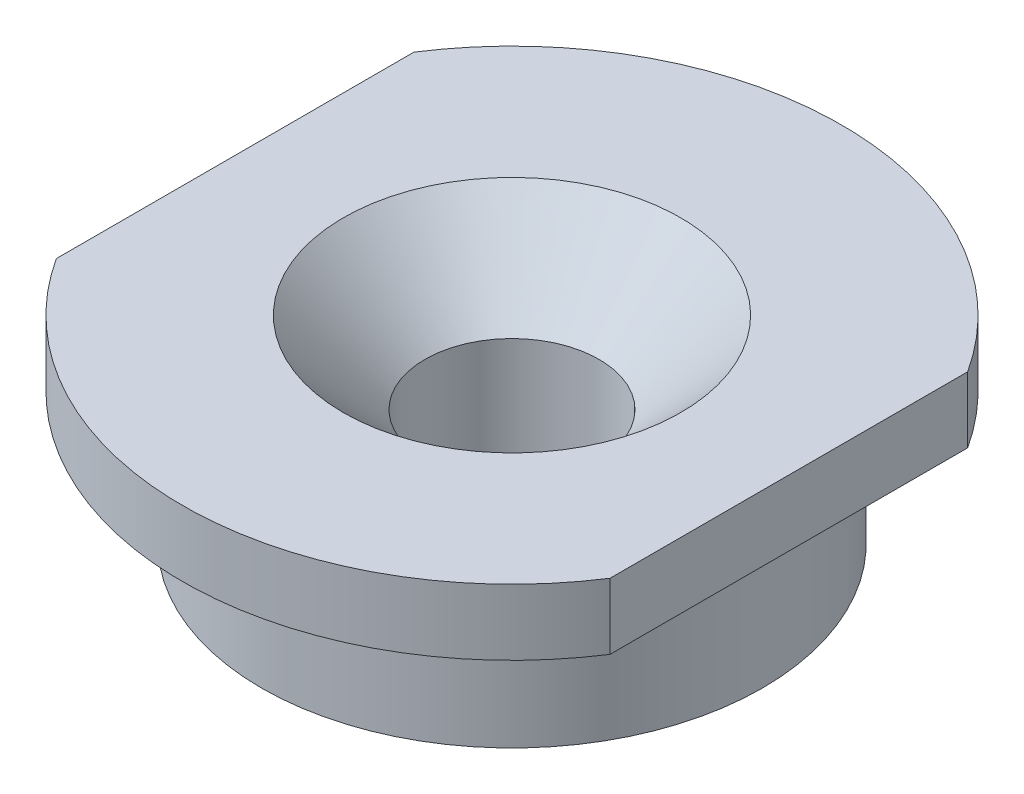
ISO-10303-21;
HEADER;
FILE_DESCRIPTION(('STEP AP214'),'2;1');
FILE_NAME('part.step','',(''),(''),'','','');
FILE_SCHEMA(('AUTOMOTIVE_DESIGN { 1 0 10303 214 1 1 1 1 }'));
ENDSEC;
DATA;
#1=APPLICATION_CONTEXT('core data for automotive mechanical design processes');
#2=APPLICATION_PROTOCOL_DEFINITION('international standard','automotive_design',2000,#1);
#3=PRODUCT_CONTEXT('',#1,'mechanical');
#4=PRODUCT('Part','Part','',(#3));
#5=PRODUCT_RELATED_PRODUCT_CATEGORY('part','',(#4));
#6=PRODUCT_DEFINITION_FORMATION('','',#4);
#7=PRODUCT_DEFINITION_CONTEXT('part definition',#1,'design');
#8=PRODUCT_DEFINITION('design','',#6,#7);
#9=PRODUCT_DEFINITION_SHAPE('','',#8);
#10=(LENGTH_UNIT() NAMED_UNIT(*) SI_UNIT(.MILLI.,.METRE.));
#11=(NAMED_UNIT(*) PLANE_ANGLE_UNIT() SI_UNIT($,.RADIAN.));
#12=(NAMED_UNIT(*) SI_UNIT($,.STERADIAN.) SOLID_ANGLE_UNIT());
#13=UNCERTAINTY_MEASURE_WITH_UNIT(LENGTH_MEASURE(1.E-05),#10,'distance_accuracy_value','');
#14=(GEOMETRIC_REPRESENTATION_CONTEXT(3) GLOBAL_UNCERTAINTY_ASSIGNED_CONTEXT((#13)) GLOBAL_UNIT_ASSIGNED_CONTEXT((#10,
#11,#12)) REPRESENTATION_CONTEXT('',''));
#15=CARTESIAN_POINT('',(0.,0.,0.));
#16=DIRECTION('',(0.,0.,1.));
#17=DIRECTION('',(1.,0.,0.));
#18=AXIS2_PLACEMENT_3D('',#15,#16,#17);
#19=CARTESIAN_POINT('',(0.,11.1140350877193,0.));
#20=DIRECTION('',(0.,1.,0.));
#21=DIRECTION('',(0.,0.,1.));
#22=AXIS2_PLACEMENT_3D('',#19,#20,#21);
#23=CYLINDRICAL_SURFACE('',#22,12.5);
#24=CARTESIAN_POINT('',(0.,7.5,0.));
#25=DIRECTION('',(0.,1.,0.));
#26=DIRECTION('',(0.,0.,1.));
#27=AXIS2_PLACEMENT_3D('',#24,#25,#26);
#28=CIRCLE('',#27,12.5);
#29=CARTESIAN_POINT('',(10.5,7.5,-6.78232998312527));
#30=VERTEX_POINT('',#29);
#31=CARTESIAN_POINT('',(-10.5,7.5,-6.78232998312527));
#32=VERTEX_POINT('',#31);
#33=EDGE_CURVE('E88',#30,#32,#28,.T.);
#34=ORIENTED_EDGE('',*,*,#33,.F.);
#35=DIRECTION('',(0.,1.,0.));
#36=VECTOR('',#35,1.);
#37=CARTESIAN_POINT('',(10.5,11.1140350877193,-6.78232998312527));
#38=LINE('',#37,#36);
#39=CARTESIAN_POINT('',(10.5,5.,-6.78232998312527));
#40=VERTEX_POINT('',#39);
#41=EDGE_CURVE('E50',#30,#40,#38,.F.);
#42=ORIENTED_EDGE('',*,*,#41,.T.);
#43=CARTESIAN_POINT('',(0.,5.,0.));
#44=DIRECTION('',(0.,1.,0.));
#45=DIRECTION('',(0.,0.,1.));
#46=AXIS2_PLACEMENT_3D('',#43,#44,#45);
#47=CIRCLE('',#46,12.5);
#48=CARTESIAN_POINT('',(-10.5,5.,-6.78232998312527));
#49=VERTEX_POINT('',#48);
#50=EDGE_CURVE('E86',#40,#49,#47,.T.);
#51=ORIENTED_EDGE('',*,*,#50,.T.);
#52=DIRECTION('',(0.,1.,0.));
#53=VECTOR('',#52,1.);
#54=CARTESIAN_POINT('',(-10.5,11.1140350877193,-6.78232998312527));
#55=LINE('',#54,#53);
#56=EDGE_CURVE('E115',#49,#32,#55,.T.);
#57=ORIENTED_EDGE('',*,*,#56,.T.);
#58=EDGE_LOOP('',(#34,#42,#51,#57));
#59=FACE_BOUND('',#58,.T.);
#60=ADVANCED_FACE('F35',(#59),#23,.T.);
#61=CARTESIAN_POINT('',(0.,0.,0.));
#62=DIRECTION('',(0.,1.,0.));
#63=DIRECTION('',(0.,0.,1.));
#64=AXIS2_PLACEMENT_3D('',#61,#62,#63);
#65=PLANE('',#64);
#66=CARTESIAN_POINT('',(0.,0.,0.));
#67=DIRECTION('',(0.,1.,0.));
#68=DIRECTION('',(0.,0.,1.));
#69=AXIS2_PLACEMENT_3D('',#66,#67,#68);
#70=CIRCLE('',#69,3.3);
#71=CARTESIAN_POINT('',(0.,0.,3.3));
#72=VERTEX_POINT('',#71);
#73=EDGE_CURVE('E122',#72,#72,#70,.T.);
#74=ORIENTED_EDGE('',*,*,#73,.T.);
#75=EDGE_LOOP('',(#74));
#76=FACE_BOUND('',#75,.T.);
#77=CARTESIAN_POINT('',(0.,0.,0.));
#78=DIRECTION('',(0.,1.,0.));
#79=DIRECTION('',(0.,0.,1.));
#80=AXIS2_PLACEMENT_3D('',#77,#78,#79);
#81=CIRCLE('',#80,9.5);
#82=CARTESIAN_POINT('',(0.,0.,9.5));
#83=VERTEX_POINT('',#82);
#84=EDGE_CURVE('E104',#83,#83,#81,.T.);
#85=ORIENTED_EDGE('',*,*,#84,.F.);
#86=EDGE_LOOP('',(#85));
#87=FACE_BOUND('',#86,.T.);
#88=ADVANCED_FACE('F37',(#76,#87),#65,.F.);
#89=CARTESIAN_POINT('',(0.,11.1140350877193,0.));
#90=DIRECTION('',(0.,1.,0.));
#91=DIRECTION('',(0.,0.,1.));
#92=AXIS2_PLACEMENT_3D('',#89,#90,#91);
#93=CYLINDRICAL_SURFACE('',#92,9.5);
#94=CARTESIAN_POINT('',(0.,5.,0.));
#95=DIRECTION('',(0.,1.,0.));
#96=DIRECTION('',(0.,0.,1.));
#97=AXIS2_PLACEMENT_3D('',#94,#95,#96);
#98=CIRCLE('',#97,9.5);
#99=CARTESIAN_POINT('',(0.,5.,9.5));
#100=VERTEX_POINT('',#99);
#101=EDGE_CURVE('E97',#100,#100,#98,.T.);
#102=ORIENTED_EDGE('',*,*,#101,.F.);
#103=EDGE_LOOP('',(#102));
#104=FACE_BOUND('',#103,.T.);
#105=ORIENTED_EDGE('',*,*,#84,.T.);
#106=EDGE_LOOP('',(#105));
#107=FACE_BOUND('',#106,.T.);
#108=ADVANCED_FACE('F151',(#104,#107),#93,.T.);
#109=CARTESIAN_POINT('',(9.5,5.,0.));
#110=DIRECTION('',(0.,1.,0.));
#111=DIRECTION('',(0.,0.,1.));
#112=AXIS2_PLACEMENT_3D('',#109,#110,#111);
#113=PLANE('',#112);
#114=ORIENTED_EDGE('',*,*,#50,.F.);
#115=DIRECTION('',(0.,0.,1.));
#116=VECTOR('',#115,1.);
#117=CARTESIAN_POINT('',(10.5,5.,-12.5));
#118=LINE('',#117,#116);
#119=CARTESIAN_POINT('',(10.5,5.,6.78232998312527));
#120=VERTEX_POINT('',#119);
#121=EDGE_CURVE('E74',#40,#120,#118,.T.);
#122=ORIENTED_EDGE('',*,*,#121,.T.);
#123=CARTESIAN_POINT('',(-10.5,5.,6.78232998312527));
#124=VERTEX_POINT('',#123);
#125=EDGE_CURVE('E94',#124,#120,#47,.T.);
#126=ORIENTED_EDGE('',*,*,#125,.F.);
#127=DIRECTION('',(0.,0.,1.));
#128=VECTOR('',#127,1.);
#129=CARTESIAN_POINT('',(-10.5,5.,-12.5));
#130=LINE('',#129,#128);
#131=EDGE_CURVE('E93',#49,#124,#130,.T.);
#132=ORIENTED_EDGE('',*,*,#131,.F.);
#133=EDGE_LOOP('',(#114,#122,#126,#132));
#134=FACE_BOUND('',#133,.T.);
#135=ORIENTED_EDGE('',*,*,#101,.T.);
#136=EDGE_LOOP('',(#135));
#137=FACE_BOUND('',#136,.T.);
#138=ADVANCED_FACE('F91',(#134,#137),#113,.F.);
#139=ORIENTED_EDGE('',*,*,#125,.T.);
#140=DIRECTION('',(0.,1.,0.));
#141=VECTOR('',#140,1.);
#142=CARTESIAN_POINT('',(10.5,11.1140350877193,6.78232998312527));
#143=LINE('',#142,#141);
#144=CARTESIAN_POINT('',(10.5,7.5,6.78232998312527));
#145=VERTEX_POINT('',#144);
#146=EDGE_CURVE('E77',#120,#145,#143,.T.);
#147=ORIENTED_EDGE('',*,*,#146,.T.);
#148=CARTESIAN_POINT('',(-10.5,7.5,6.78232998312527));
#149=VERTEX_POINT('',#148);
#150=EDGE_CURVE('E95',#149,#145,#28,.T.);
#151=ORIENTED_EDGE('',*,*,#150,.F.);
#152=DIRECTION('',(0.,1.,0.));
#153=VECTOR('',#152,1.);
#154=CARTESIAN_POINT('',(-10.5,11.1140350877193,6.78232998312527));
#155=LINE('',#154,#153);
#156=EDGE_CURVE('E57',#149,#124,#155,.F.);
#157=ORIENTED_EDGE('',*,*,#156,.T.);
#158=EDGE_LOOP('',(#139,#147,#151,#157));
#159=FACE_BOUND('',#158,.T.);
#160=ADVANCED_FACE('F110',(#159),#23,.T.);
#161=CARTESIAN_POINT('',(12.5,7.5,0.));
#162=DIRECTION('',(0.,-1.,0.));
#163=DIRECTION('',(0.,0.,-1.));
#164=AXIS2_PLACEMENT_3D('',#161,#162,#163);
#165=PLANE('',#164);
#166=CARTESIAN_POINT('',(0.,7.5,0.));
#167=DIRECTION('',(0.,1.,0.));
#168=DIRECTION('',(0.,0.,1.));
#169=AXIS2_PLACEMENT_3D('',#166,#167,#168);
#170=CIRCLE('',#169,6.4);
#171=CARTESIAN_POINT('',(0.,7.5,6.4));
#172=VERTEX_POINT('',#171);
#173=EDGE_CURVE('E117',#172,#172,#170,.T.);
#174=ORIENTED_EDGE('',*,*,#173,.F.);
#175=EDGE_LOOP('',(#174));
#176=FACE_BOUND('',#175,.T.);
#177=ORIENTED_EDGE('',*,*,#150,.T.);
#178=DIRECTION('',(0.,0.,-1.));
#179=VECTOR('',#178,1.);
#180=CARTESIAN_POINT('',(10.5,7.5,0.));
#181=LINE('',#180,#179);
#182=EDGE_CURVE('E11',#145,#30,#181,.T.);
#183=ORIENTED_EDGE('',*,*,#182,.T.);
#184=ORIENTED_EDGE('',*,*,#33,.T.);
#185=DIRECTION('',(0.,0.,1.));
#186=VECTOR('',#185,1.);
#187=CARTESIAN_POINT('',(-10.5,7.5,0.));
#188=LINE('',#187,#186);
#189=EDGE_CURVE('E43',#32,#149,#188,.T.);
#190=ORIENTED_EDGE('',*,*,#189,.T.);
#191=EDGE_LOOP('',(#177,#183,#184,#190));
#192=FACE_BOUND('',#191,.T.);
#193=ADVANCED_FACE('F108',(#176,#192),#165,.F.);
#194=CARTESIAN_POINT('',(0.,7.5,0.));
#195=DIRECTION('',(0.,1.,0.));
#196=DIRECTION('',(0.,0.,1.));
#197=AXIS2_PLACEMENT_3D('',#194,#195,#196);
#198=CYLINDRICAL_SURFACE('',#197,3.3);
#199=ORIENTED_EDGE('',*,*,#73,.F.);
#200=EDGE_LOOP('',(#199));
#201=FACE_BOUND('',#200,.T.);
#202=CARTESIAN_POINT('',(0.,4.4,0.));
#203=DIRECTION('',(0.,1.,0.));
#204=DIRECTION('',(0.,0.,1.));
#205=AXIS2_PLACEMENT_3D('',#202,#203,#204);
#206=CIRCLE('',#205,3.3);
#207=CARTESIAN_POINT('',(0.,4.4,3.3));
#208=VERTEX_POINT('',#207);
#209=EDGE_CURVE('E120',#208,#208,#206,.T.);
#210=ORIENTED_EDGE('',*,*,#209,.T.);
#211=EDGE_LOOP('',(#210));
#212=FACE_BOUND('',#211,.T.);
#213=ADVANCED_FACE('F128',(#201,#212),#198,.F.);
#214=CARTESIAN_POINT('',(0.,7.5,0.));
#215=DIRECTION('',(0.,1.,0.));
#216=DIRECTION('',(0.,0.,1.));
#217=AXIS2_PLACEMENT_3D('',#214,#215,#216);
#218=CONICAL_SURFACE('',#217,6.4,0.785398163397449);
#219=ORIENTED_EDGE('',*,*,#209,.F.);
#220=EDGE_LOOP('',(#219));
#221=FACE_BOUND('',#220,.T.);
#222=ORIENTED_EDGE('',*,*,#173,.T.);
#223=EDGE_LOOP('',(#222));
#224=FACE_BOUND('',#223,.T.);
#225=ADVANCED_FACE('F131',(#221,#224),#218,.F.);
#226=CARTESIAN_POINT('',(-10.5,5.,-12.5));
#227=DIRECTION('',(1.,0.,0.));
#228=DIRECTION('',(0.,0.,-1.));
#229=AXIS2_PLACEMENT_3D('',#226,#227,#228);
#230=PLANE('',#229);
#231=ORIENTED_EDGE('',*,*,#131,.T.);
#232=ORIENTED_EDGE('',*,*,#156,.F.);
#233=ORIENTED_EDGE('',*,*,#189,.F.);
#234=ORIENTED_EDGE('',*,*,#56,.F.);
#235=EDGE_LOOP('',(#231,#232,#233,#234));
#236=FACE_BOUND('',#235,.T.);
#237=ADVANCED_FACE('F137',(#236),#230,.F.);
#238=CARTESIAN_POINT('',(10.5,5.,-12.5));
#239=DIRECTION('',(-1.,0.,0.));
#240=DIRECTION('',(0.,0.,1.));
#241=AXIS2_PLACEMENT_3D('',#238,#239,#240);
#242=PLANE('',#241);
#243=ORIENTED_EDGE('',*,*,#121,.F.);
#244=ORIENTED_EDGE('',*,*,#41,.F.);
#245=ORIENTED_EDGE('',*,*,#182,.F.);
#246=ORIENTED_EDGE('',*,*,#146,.F.);
#247=EDGE_LOOP('',(#243,#244,#245,#246));
#248=FACE_BOUND('',#247,.T.);
#249=ADVANCED_FACE('F75',(#248),#242,.F.);
#250=CLOSED_SHELL('',(#60,#88,#108,#138,#160,#193,#213,#225,#237,#249));
#251=MANIFOLD_SOLID_BREP('B2',#250);
#252=ADVANCED_BREP_SHAPE_REPRESENTATION('',(#18,#251),#14);
#253=SHAPE_DEFINITION_REPRESENTATION(#9,#252);
ENDSEC;
END-ISO-10303-21;
